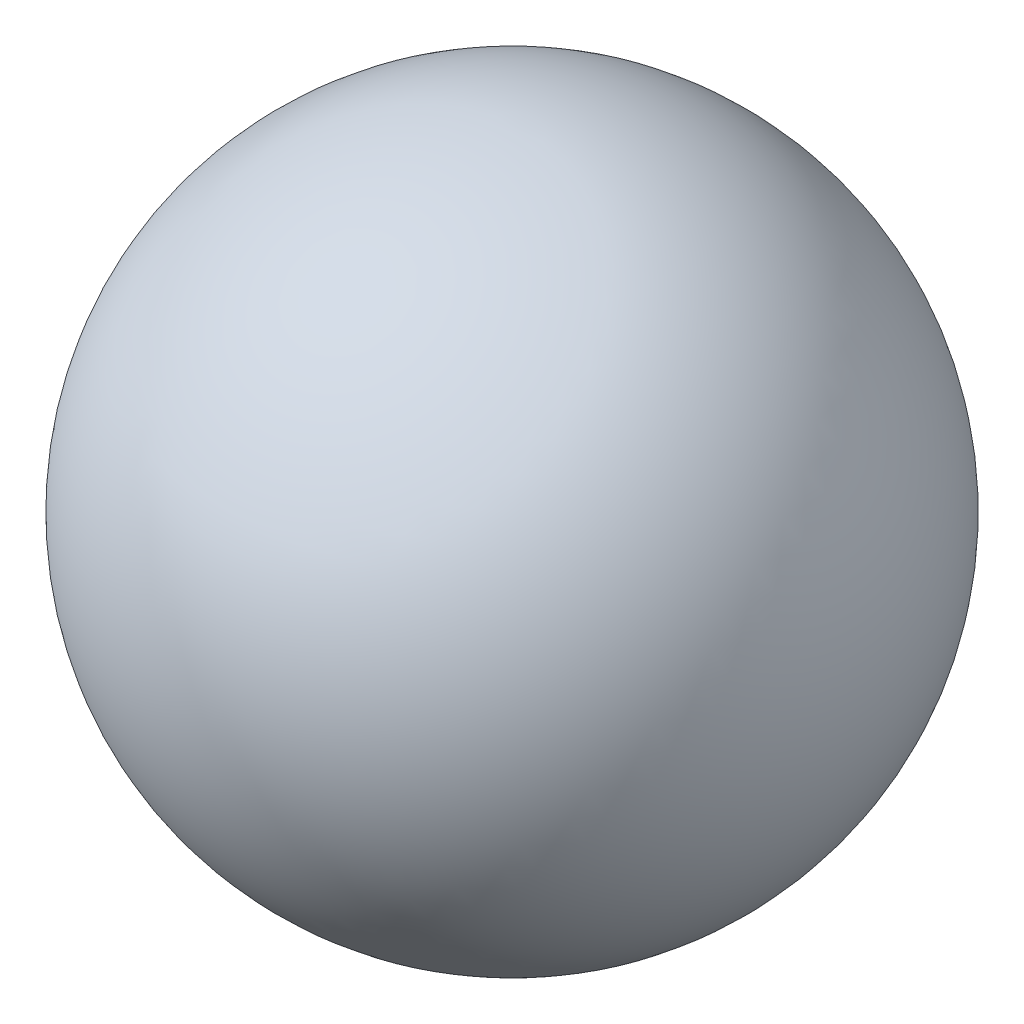
ISO-10303-21;
HEADER;
FILE_DESCRIPTION(('STEP AP214'),'2;1');
FILE_NAME('part.step','',(''),(''),'','','');
FILE_SCHEMA(('AUTOMOTIVE_DESIGN { 1 0 10303 214 1 1 1 1 }'));
ENDSEC;
DATA;
#1=APPLICATION_CONTEXT('core data for automotive mechanical design processes');
#2=APPLICATION_PROTOCOL_DEFINITION('international standard','automotive_design',2000,#1);
#3=PRODUCT_CONTEXT('',#1,'mechanical');
#4=PRODUCT('Part','Part','',(#3));
#5=PRODUCT_RELATED_PRODUCT_CATEGORY('part','',(#4));
#6=PRODUCT_DEFINITION_FORMATION('','',#4);
#7=PRODUCT_DEFINITION_CONTEXT('part definition',#1,'design');
#8=PRODUCT_DEFINITION('design','',#6,#7);
#9=PRODUCT_DEFINITION_SHAPE('','',#8);
#10=(LENGTH_UNIT() NAMED_UNIT(*) SI_UNIT(.MILLI.,.METRE.));
#11=(NAMED_UNIT(*) PLANE_ANGLE_UNIT() SI_UNIT($,.RADIAN.));
#12=(NAMED_UNIT(*) SI_UNIT($,.STERADIAN.) SOLID_ANGLE_UNIT());
#13=UNCERTAINTY_MEASURE_WITH_UNIT(LENGTH_MEASURE(1.E-05),#10,'distance_accuracy_value','');
#14=(GEOMETRIC_REPRESENTATION_CONTEXT(3) GLOBAL_UNCERTAINTY_ASSIGNED_CONTEXT((#13)) GLOBAL_UNIT_ASSIGNED_CONTEXT((#10,
#11,#12)) REPRESENTATION_CONTEXT('',''));
#15=CARTESIAN_POINT('',(0.,0.,0.));
#16=DIRECTION('',(0.,0.,1.));
#17=DIRECTION('',(1.,0.,0.));
#18=AXIS2_PLACEMENT_3D('',#15,#16,#17);
#19=CARTESIAN_POINT('',(0.,0.,0.));
#20=DIRECTION('',(0.,1.,0.));
#21=DIRECTION('',(1.,0.,0.));
#22=AXIS2_PLACEMENT_3D('',#19,#20,#21);
#23=SPHERICAL_SURFACE('',#22,6.25);
#24=CARTESIAN_POINT('',(0.,6.25,0.));
#25=VERTEX_POINT('',#24);
#26=VERTEX_LOOP('',#25);
#27=FACE_BOUND('',#26,.T.);
#28=ADVANCED_FACE('F26',(#27),#23,.T.);
#29=CLOSED_SHELL('',(#28));
#30=MANIFOLD_SOLID_BREP('B2',#29);
#31=ADVANCED_BREP_SHAPE_REPRESENTATION('',(#18,#30),#14);
#32=SHAPE_DEFINITION_REPRESENTATION(#9,#31);
ENDSEC;
END-ISO-10303-21;
